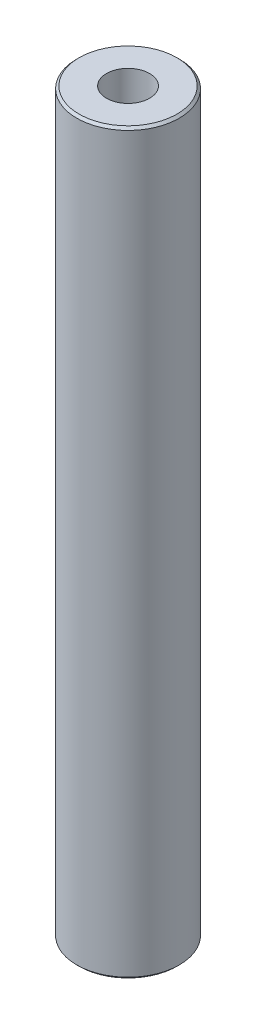
ISO-10303-21;
HEADER;
FILE_DESCRIPTION(('STEP AP214'),'2;1');
FILE_NAME('part.step','',(''),(''),'','','');
FILE_SCHEMA(('AUTOMOTIVE_DESIGN { 1 0 10303 214 1 1 1 1 }'));
ENDSEC;
DATA;
#1=APPLICATION_CONTEXT('core data for automotive mechanical design processes');
#2=APPLICATION_PROTOCOL_DEFINITION('international standard','automotive_design',2000,#1);
#3=PRODUCT_CONTEXT('',#1,'mechanical');
#4=PRODUCT('Part','Part','',(#3));
#5=PRODUCT_RELATED_PRODUCT_CATEGORY('part','',(#4));
#6=PRODUCT_DEFINITION_FORMATION('','',#4);
#7=PRODUCT_DEFINITION_CONTEXT('part definition',#1,'design');
#8=PRODUCT_DEFINITION('design','',#6,#7);
#9=PRODUCT_DEFINITION_SHAPE('','',#8);
#10=(LENGTH_UNIT() NAMED_UNIT(*) SI_UNIT(.MILLI.,.METRE.));
#11=(NAMED_UNIT(*) PLANE_ANGLE_UNIT() SI_UNIT($,.RADIAN.));
#12=(NAMED_UNIT(*) SI_UNIT($,.STERADIAN.) SOLID_ANGLE_UNIT());
#13=UNCERTAINTY_MEASURE_WITH_UNIT(LENGTH_MEASURE(1.E-05),#10,'distance_accuracy_value','');
#14=(GEOMETRIC_REPRESENTATION_CONTEXT(3) GLOBAL_UNCERTAINTY_ASSIGNED_CONTEXT((#13)) GLOBAL_UNIT_ASSIGNED_CONTEXT((#10,
#11,#12)) REPRESENTATION_CONTEXT('',''));
#15=CARTESIAN_POINT('',(0.,0.,0.));
#16=DIRECTION('',(0.,0.,1.));
#17=DIRECTION('',(1.,0.,0.));
#18=AXIS2_PLACEMENT_3D('',#15,#16,#17);
#19=CARTESIAN_POINT('',(0.,359.907576154649,0.));
#20=DIRECTION('',(0.,-1.,0.));
#21=DIRECTION('',(0.,0.,-1.));
#22=AXIS2_PLACEMENT_3D('',#19,#20,#21);
#23=CYLINDRICAL_SURFACE('',#22,25.);
#24=CARTESIAN_POINT('',(0.,358.760323781845,0.));
#25=DIRECTION('',(0.,1.,0.));
#26=DIRECTION('',(0.,0.,1.));
#27=AXIS2_PLACEMENT_3D('',#24,#25,#26);
#28=CIRCLE('',#27,25.);
#29=CARTESIAN_POINT('',(0.,358.760323781845,-25.));
#30=VERTEX_POINT('',#29);
#31=EDGE_CURVE('E50',#30,#30,#28,.F.);
#32=ORIENTED_EDGE('',*,*,#31,.T.);
#33=EDGE_LOOP('',(#32));
#34=FACE_BOUND('',#33,.T.);
#35=CARTESIAN_POINT('',(0.,1.14725237280389,0.));
#36=DIRECTION('',(0.,1.,0.));
#37=DIRECTION('',(0.,0.,1.));
#38=AXIS2_PLACEMENT_3D('',#35,#36,#37);
#39=CIRCLE('',#38,25.);
#40=CARTESIAN_POINT('',(0.,1.14725237280389,25.));
#41=VERTEX_POINT('',#40);
#42=EDGE_CURVE('E51',#41,#41,#39,.T.);
#43=ORIENTED_EDGE('',*,*,#42,.T.);
#44=EDGE_LOOP('',(#43));
#45=FACE_BOUND('',#44,.T.);
#46=ADVANCED_FACE('F39',(#34,#45),#23,.T.);
#47=CARTESIAN_POINT('',(0.,359.907576154649,0.));
#48=DIRECTION('',(0.,1.,0.));
#49=DIRECTION('',(0.,0.,1.));
#50=AXIS2_PLACEMENT_3D('',#47,#48,#49);
#51=PLANE('',#50);
#52=CARTESIAN_POINT('',(0.,359.907576154649,0.));
#53=DIRECTION('',(0.,1.,0.));
#54=DIRECTION('',(0.,0.,1.));
#55=AXIS2_PLACEMENT_3D('',#52,#53,#54);
#56=CIRCLE('',#55,23.8527476271962);
#57=CARTESIAN_POINT('',(0.,359.907576154649,-23.8527476271962));
#58=VERTEX_POINT('',#57);
#59=EDGE_CURVE('E54',#58,#58,#56,.T.);
#60=ORIENTED_EDGE('',*,*,#59,.T.);
#61=EDGE_LOOP('',(#60));
#62=FACE_BOUND('',#61,.T.);
#63=CARTESIAN_POINT('',(0.,359.907576154649,0.));
#64=DIRECTION('',(0.,1.,0.));
#65=DIRECTION('',(0.,0.,1.));
#66=AXIS2_PLACEMENT_3D('',#63,#64,#65);
#67=CIRCLE('',#66,10.4973073025688);
#68=CARTESIAN_POINT('',(0.,359.907576154649,10.4973073025688));
#69=VERTEX_POINT('',#68);
#70=EDGE_CURVE('E58',#69,#69,#67,.T.);
#71=ORIENTED_EDGE('',*,*,#70,.F.);
#72=EDGE_LOOP('',(#71));
#73=FACE_BOUND('',#72,.T.);
#74=ADVANCED_FACE('F69',(#62,#73),#51,.T.);
#75=CARTESIAN_POINT('',(0.,0.,0.));
#76=DIRECTION('',(0.,1.,0.));
#77=DIRECTION('',(0.,0.,1.));
#78=AXIS2_PLACEMENT_3D('',#75,#76,#77);
#79=PLANE('',#78);
#80=CARTESIAN_POINT('',(0.,0.,0.));
#81=DIRECTION('',(0.,1.,0.));
#82=DIRECTION('',(0.,0.,1.));
#83=AXIS2_PLACEMENT_3D('',#80,#81,#82);
#84=CIRCLE('',#83,23.8527476271961);
#85=CARTESIAN_POINT('',(0.,0.,23.8527476271961));
#86=VERTEX_POINT('',#85);
#87=EDGE_CURVE('E10',#86,#86,#84,.F.);
#88=ORIENTED_EDGE('',*,*,#87,.T.);
#89=EDGE_LOOP('',(#88));
#90=FACE_BOUND('',#89,.T.);
#91=CARTESIAN_POINT('',(0.,0.,0.));
#92=DIRECTION('',(0.,1.,0.));
#93=DIRECTION('',(0.,0.,1.));
#94=AXIS2_PLACEMENT_3D('',#91,#92,#93);
#95=CIRCLE('',#94,10.4973073025688);
#96=CARTESIAN_POINT('',(0.,0.,10.4973073025688));
#97=VERTEX_POINT('',#96);
#98=EDGE_CURVE('E63',#97,#97,#95,.T.);
#99=ORIENTED_EDGE('',*,*,#98,.T.);
#100=EDGE_LOOP('',(#99));
#101=FACE_BOUND('',#100,.T.);
#102=ADVANCED_FACE('F75',(#90,#101),#79,.F.);
#103=CARTESIAN_POINT('',(0.,359.907576154649,0.));
#104=DIRECTION('',(0.,-1.,0.));
#105=DIRECTION('',(0.,0.,-1.));
#106=AXIS2_PLACEMENT_3D('',#103,#104,#105);
#107=CYLINDRICAL_SURFACE('',#106,10.4973073025688);
#108=ORIENTED_EDGE('',*,*,#70,.T.);
#109=EDGE_LOOP('',(#108));
#110=FACE_BOUND('',#109,.T.);
#111=ORIENTED_EDGE('',*,*,#98,.F.);
#112=EDGE_LOOP('',(#111));
#113=FACE_BOUND('',#112,.T.);
#114=ADVANCED_FACE('F70',(#110,#113),#107,.F.);
#115=CARTESIAN_POINT('',(0.,359.907576154649,0.));
#116=DIRECTION('',(0.,-1.,0.));
#117=DIRECTION('',(0.,0.,-1.));
#118=AXIS2_PLACEMENT_3D('',#115,#116,#117);
#119=CONICAL_SURFACE('',#118,23.8527476271962,0.785398163397439);
#120=CARTESIAN_POINT('',(0.,358.760323781845,-25.));
#121=CARTESIAN_POINT('',(0.,358.772274327395,-24.98804945445));
#122=CARTESIAN_POINT('',(0.,358.784224872945,-24.9760989089));
#123=CARTESIAN_POINT('',(0.,358.808125964045,-24.9521978177999));
#124=CARTESIAN_POINT('',(0.,358.820076509595,-24.9402472722498));
#125=CARTESIAN_POINT('',(0.,358.843977600695,-24.9163461811498));
#126=CARTESIAN_POINT('',(0.,358.855928146246,-24.9043956355997));
#127=CARTESIAN_POINT('',(0.,358.879829237346,-24.8804945444996));
#128=CARTESIAN_POINT('',(0.,358.891779782896,-24.8685439989496));
#129=CARTESIAN_POINT('',(0.,358.915680873996,-24.8446429078495));
#130=CARTESIAN_POINT('',(0.,358.927631419546,-24.8326923622995));
#131=CARTESIAN_POINT('',(0.,358.951532510646,-24.8087912711994));
#132=CARTESIAN_POINT('',(0.,358.963483056196,-24.7968407256494));
#133=CARTESIAN_POINT('',(0.,358.987384147296,-24.7729396345493));
#134=CARTESIAN_POINT('',(0.,358.999334692846,-24.7609890889992));
#135=CARTESIAN_POINT('',(0.,359.023235783946,-24.7370879978992));
#136=CARTESIAN_POINT('',(0.,359.035186329496,-24.7251374523491));
#137=CARTESIAN_POINT('',(0.,359.059087420596,-24.701236361249));
#138=CARTESIAN_POINT('',(0.,359.071037966146,-24.689285815699));
#139=CARTESIAN_POINT('',(0.,359.094939057246,-24.6653847245989));
#140=CARTESIAN_POINT('',(0.,359.106889602796,-24.6534341790489));
#141=CARTESIAN_POINT('',(0.,359.130790693896,-24.6295330879488));
#142=CARTESIAN_POINT('',(0.,359.142741239446,-24.6175825423988));
#143=CARTESIAN_POINT('',(0.,359.166642330546,-24.5936814512987));
#144=CARTESIAN_POINT('',(0.,359.178592876097,-24.5817309057486));
#145=CARTESIAN_POINT('',(0.,359.202493967197,-24.5578298146486));
#146=CARTESIAN_POINT('',(0.,359.214444512747,-24.5458792690985));
#147=CARTESIAN_POINT('',(0.,359.238345603847,-24.5219781779984));
#148=CARTESIAN_POINT('',(0.,359.250296149397,-24.5100276324484));
#149=CARTESIAN_POINT('',(0.,359.274197240497,-24.4861265413483));
#150=CARTESIAN_POINT('',(0.,359.286147786047,-24.4741759957983));
#151=CARTESIAN_POINT('',(0.,359.310048877147,-24.4502749046982));
#152=CARTESIAN_POINT('',(0.,359.321999422697,-24.4383243591482));
#153=CARTESIAN_POINT('',(0.,359.345900513797,-24.4144232680481));
#154=CARTESIAN_POINT('',(0.,359.357851059347,-24.402472722498));
#155=CARTESIAN_POINT('',(0.,359.381752150447,-24.378571631398));
#156=CARTESIAN_POINT('',(0.,359.393702695997,-24.3666210858479));
#157=CARTESIAN_POINT('',(0.,359.417603787097,-24.3427199947478));
#158=CARTESIAN_POINT('',(0.,359.429554332647,-24.3307694491978));
#159=CARTESIAN_POINT('',(0.,359.453455423747,-24.3068683580977));
#160=CARTESIAN_POINT('',(0.,359.465405969298,-24.2949178125477));
#161=CARTESIAN_POINT('',(0.,359.489307060398,-24.2710167214476));
#162=CARTESIAN_POINT('',(0.,359.501257605948,-24.2590661758976));
#163=CARTESIAN_POINT('',(0.,359.525158697048,-24.2351650847975));
#164=CARTESIAN_POINT('',(0.,359.537109242598,-24.2232145392474));
#165=CARTESIAN_POINT('',(0.,359.561010333698,-24.1993134481474));
#166=CARTESIAN_POINT('',(0.,359.572960879248,-24.1873629025973));
#167=CARTESIAN_POINT('',(0.,359.596861970348,-24.1634618114973));
#168=CARTESIAN_POINT('',(0.,359.608812515898,-24.1515112659472));
#169=CARTESIAN_POINT('',(0.,359.632713606998,-24.1276101748471));
#170=CARTESIAN_POINT('',(0.,359.644664152548,-24.1156596292971));
#171=CARTESIAN_POINT('',(0.,359.668565243648,-24.091758538197));
#172=CARTESIAN_POINT('',(0.,359.680515789198,-24.079807992647));
#173=CARTESIAN_POINT('',(0.,359.704416880298,-24.0559069015469));
#174=CARTESIAN_POINT('',(0.,359.716367425848,-24.0439563559968));
#175=CARTESIAN_POINT('',(0.,359.740268516948,-24.0200552648968));
#176=CARTESIAN_POINT('',(0.,359.752219062499,-24.0081047193467));
#177=CARTESIAN_POINT('',(0.,359.776120153599,-23.9842036282467));
#178=CARTESIAN_POINT('',(0.,359.788070699149,-23.9722530826966));
#179=CARTESIAN_POINT('',(0.,359.811971790249,-23.9483519915965));
#180=CARTESIAN_POINT('',(0.,359.823922335799,-23.9364014460465));
#181=CARTESIAN_POINT('',(0.,359.847823426899,-23.9125003549464));
#182=CARTESIAN_POINT('',(0.,359.859773972449,-23.9005498093964));
#183=CARTESIAN_POINT('',(0.,359.883675063549,-23.8766487182963));
#184=CARTESIAN_POINT('',(0.,359.895625609099,-23.8646981727462));
#185=CARTESIAN_POINT('',(0.,359.907576154649,-23.8527476271962));
#186=B_SPLINE_CURVE_WITH_KNOTS('',3,(#120,#121,#122,#123,#124,#125,#126,#127,#128,#129,#130,
#131,#132,#133,#134,#135,#136,#137,#138,#139,#140,#141,#142,#143,#144,#145,#146,#147,#148,#149,
#150,#151,#152,#153,#154,#155,#156,#157,#158,#159,#160,#161,#162,#163,#164,#165,#166,#167,#168,
#169,#170,#171,#172,#173,#174,#175,#176,#177,#178,#179,#180,#181,#182,#183,#184,#185),
.UNSPECIFIED.,.F.,.F.,(4,2,2,2,2,2,2,2,2,2,2,2,2,2,2,2,2,2,2,2,2,2,2,2,2,2,2,2,2,2,2,2,4),(0.,
0.0507018707838937,0.101403741567748,0.152105612351644,0.202807483135499,0.253509353919392,
0.304211224703249,0.354913095487104,0.405614966270997,0.456316837054854,0.507018707838748,
0.557720578622602,0.608422449406459,0.659124320190353,0.709826190974208,0.760528061758104,
0.811229932541958,0.861931803325812,0.912633674109709,0.963335544893563,1.01403741567746,
1.06473928646131,1.11544115724517,1.16614302802906,1.21684489881292,1.26754676959681,
1.31824864038067,1.36895051116452,1.41965238194842,1.47035425273227,1.52105612351617,
1.57175799430002,1.62245986508392),.UNSPECIFIED.);
#187=EDGE_CURVE('BSEAM81',#30,#58,#186,.T.);
#188=ORIENTED_EDGE('',*,*,#31,.F.);
#189=ORIENTED_EDGE('',*,*,#59,.F.);
#190=ORIENTED_EDGE('',*,*,#187,.T.);
#191=ORIENTED_EDGE('',*,*,#187,.F.);
#192=EDGE_LOOP('',(#188,#190,#189,#191));
#193=FACE_BOUND('',#192,.T.);
#194=ADVANCED_FACE('F81',(#193),#119,.T.);
#195=CARTESIAN_POINT('',(0.,1.14725237280389,0.));
#196=DIRECTION('',(0.,1.,0.));
#197=DIRECTION('',(0.,0.,1.));
#198=AXIS2_PLACEMENT_3D('',#195,#196,#197);
#199=CONICAL_SURFACE('',#198,25.,0.785398163397462);
#200=ORIENTED_EDGE('',*,*,#87,.F.);
#201=EDGE_LOOP('',(#200));
#202=FACE_BOUND('',#201,.T.);
#203=ORIENTED_EDGE('',*,*,#42,.F.);
#204=EDGE_LOOP('',(#203));
#205=FACE_BOUND('',#204,.T.);
#206=ADVANCED_FACE('F45',(#202,#205),#199,.T.);
#207=CLOSED_SHELL('',(#46,#74,#102,#114,#194,#206));
#208=MANIFOLD_SOLID_BREP('B2',#207);
#209=ADVANCED_BREP_SHAPE_REPRESENTATION('',(#18,#208),#14);
#210=SHAPE_DEFINITION_REPRESENTATION(#9,#209);
ENDSEC;
END-ISO-10303-21;
